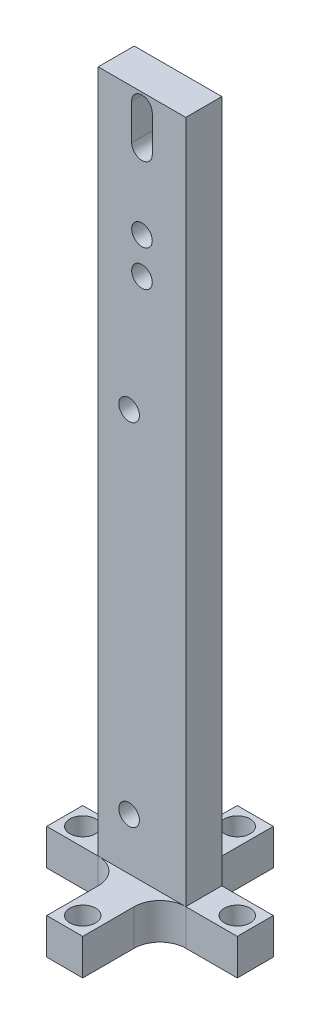
ISO-10303-21;
HEADER;
FILE_DESCRIPTION(('STEP AP214'),'2;1');
FILE_NAME('part.step','',(''),(''),'','','');
FILE_SCHEMA(('AUTOMOTIVE_DESIGN { 1 0 10303 214 1 1 1 1 }'));
ENDSEC;
DATA;
#1=APPLICATION_CONTEXT('core data for automotive mechanical design processes');
#2=APPLICATION_PROTOCOL_DEFINITION('international standard','automotive_design',2000,#1);
#3=PRODUCT_CONTEXT('',#1,'mechanical');
#4=PRODUCT('Part','Part','',(#3));
#5=PRODUCT_RELATED_PRODUCT_CATEGORY('part','',(#4));
#6=PRODUCT_DEFINITION_FORMATION('','',#4);
#7=PRODUCT_DEFINITION_CONTEXT('part definition',#1,'design');
#8=PRODUCT_DEFINITION('design','',#6,#7);
#9=PRODUCT_DEFINITION_SHAPE('','',#8);
#10=(LENGTH_UNIT() NAMED_UNIT(*) SI_UNIT(.MILLI.,.METRE.));
#11=(NAMED_UNIT(*) PLANE_ANGLE_UNIT() SI_UNIT($,.RADIAN.));
#12=(NAMED_UNIT(*) SI_UNIT($,.STERADIAN.) SOLID_ANGLE_UNIT());
#13=UNCERTAINTY_MEASURE_WITH_UNIT(LENGTH_MEASURE(1.E-05),#10,'distance_accuracy_value','');
#14=(GEOMETRIC_REPRESENTATION_CONTEXT(3) GLOBAL_UNCERTAINTY_ASSIGNED_CONTEXT((#13)) GLOBAL_UNIT_ASSIGNED_CONTEXT((#10,
#11,#12)) REPRESENTATION_CONTEXT('',''));
#15=CARTESIAN_POINT('',(0.,0.,0.));
#16=DIRECTION('',(0.,0.,1.));
#17=DIRECTION('',(1.,0.,0.));
#18=AXIS2_PLACEMENT_3D('',#15,#16,#17);
#19=CARTESIAN_POINT('',(8.5,139.7,3.5));
#20=DIRECTION('',(0.,0.,-1.));
#21=DIRECTION('',(-1.,0.,0.));
#22=AXIS2_PLACEMENT_3D('',#19,#20,#21);
#23=PLANE('',#22);
#24=DIRECTION('',(1.,0.,0.));
#25=VECTOR('',#24,1.);
#26=CARTESIAN_POINT('',(3.5,7.,3.5));
#27=LINE('',#26,#25);
#28=CARTESIAN_POINT('',(8.5,7.,3.5));
#29=VERTEX_POINT('',#28);
#30=CARTESIAN_POINT('',(18.5,7.,3.5));
#31=VERTEX_POINT('',#30);
#32=EDGE_CURVE('E306',#29,#31,#27,.T.);
#33=ORIENTED_EDGE('',*,*,#32,.F.);
#34=DIRECTION('',(0.,-1.,0.));
#35=VECTOR('',#34,1.);
#36=CARTESIAN_POINT('',(8.5,0.,3.5));
#37=LINE('',#36,#35);
#38=CARTESIAN_POINT('',(8.5,0.,3.5));
#39=VERTEX_POINT('',#38);
#40=EDGE_CURVE('E456',#29,#39,#37,.T.);
#41=ORIENTED_EDGE('',*,*,#40,.T.);
#42=DIRECTION('',(1.,0.,0.));
#43=VECTOR('',#42,1.);
#44=CARTESIAN_POINT('',(8.5,0.,3.5));
#45=LINE('',#44,#43);
#46=CARTESIAN_POINT('',(18.5,0.,3.5));
#47=VERTEX_POINT('',#46);
#48=EDGE_CURVE('E395',#39,#47,#45,.T.);
#49=ORIENTED_EDGE('',*,*,#48,.T.);
#50=DIRECTION('',(0.,-1.,0.));
#51=VECTOR('',#50,1.);
#52=CARTESIAN_POINT('',(18.5,7.,3.5));
#53=LINE('',#52,#51);
#54=EDGE_CURVE('E364',#31,#47,#53,.T.);
#55=ORIENTED_EDGE('',*,*,#54,.F.);
#56=EDGE_LOOP('',(#33,#41,#49,#55));
#57=FACE_BOUND('',#56,.T.);
#58=ADVANCED_FACE('F38',(#57),#23,.F.);
#59=CARTESIAN_POINT('',(-18.5,0.,3.50000000000022));
#60=VERTEX_POINT('',#59);
#61=CARTESIAN_POINT('',(-8.5,0.,3.5));
#62=VERTEX_POINT('',#61);
#63=EDGE_CURVE('E411',#60,#62,#45,.T.);
#64=ORIENTED_EDGE('',*,*,#63,.T.);
#65=DIRECTION('',(0.,-1.,0.));
#66=VECTOR('',#65,1.);
#67=CARTESIAN_POINT('',(-8.5,7.00000000000001,3.5));
#68=LINE('',#67,#66);
#69=CARTESIAN_POINT('',(-8.5,7.00000000000001,3.5));
#70=VERTEX_POINT('',#69);
#71=EDGE_CURVE('E452',#62,#70,#68,.F.);
#72=ORIENTED_EDGE('',*,*,#71,.T.);
#73=DIRECTION('',(1.,0.,0.));
#74=VECTOR('',#73,1.);
#75=CARTESIAN_POINT('',(-18.5,7.,3.50000000000022));
#76=LINE('',#75,#74);
#77=CARTESIAN_POINT('',(-18.5,7.,3.50000000000022));
#78=VERTEX_POINT('',#77);
#79=EDGE_CURVE('E292',#78,#70,#76,.T.);
#80=ORIENTED_EDGE('',*,*,#79,.F.);
#81=DIRECTION('',(0.,-1.,0.));
#82=VECTOR('',#81,1.);
#83=CARTESIAN_POINT('',(-18.5,7.,3.50000000000022));
#84=LINE('',#83,#82);
#85=EDGE_CURVE('E376',#78,#60,#84,.T.);
#86=ORIENTED_EDGE('',*,*,#85,.T.);
#87=EDGE_LOOP('',(#64,#72,#80,#86));
#88=FACE_BOUND('',#87,.T.);
#89=ADVANCED_FACE('F497',(#88),#23,.F.);
#90=CARTESIAN_POINT('',(8.5,139.7,-3.5));
#91=DIRECTION('',(0.,0.,1.));
#92=DIRECTION('',(1.,0.,0.));
#93=AXIS2_PLACEMENT_3D('',#90,#91,#92);
#94=PLANE('',#93);
#95=DIRECTION('',(-1.,0.,0.));
#96=VECTOR('',#95,1.);
#97=CARTESIAN_POINT('',(-8.5,7.,-3.5));
#98=LINE('',#97,#96);
#99=CARTESIAN_POINT('',(-8.5,7.00000000000001,-3.5));
#100=VERTEX_POINT('',#99);
#101=CARTESIAN_POINT('',(-18.5,7.,-3.5));
#102=VERTEX_POINT('',#101);
#103=EDGE_CURVE('E285',#100,#102,#98,.T.);
#104=ORIENTED_EDGE('',*,*,#103,.F.);
#105=DIRECTION('',(0.,-1.,0.));
#106=VECTOR('',#105,1.);
#107=CARTESIAN_POINT('',(-8.5,0.,-3.5));
#108=LINE('',#107,#106);
#109=CARTESIAN_POINT('',(-8.5,0.,-3.5));
#110=VERTEX_POINT('',#109);
#111=EDGE_CURVE('E441',#100,#110,#108,.T.);
#112=ORIENTED_EDGE('',*,*,#111,.T.);
#113=DIRECTION('',(-1.,0.,0.));
#114=VECTOR('',#113,1.);
#115=CARTESIAN_POINT('',(8.5,0.,-3.5));
#116=LINE('',#115,#114);
#117=CARTESIAN_POINT('',(-18.5,0.,-3.5));
#118=VERTEX_POINT('',#117);
#119=EDGE_CURVE('E415',#110,#118,#116,.T.);
#120=ORIENTED_EDGE('',*,*,#119,.T.);
#121=DIRECTION('',(0.,-1.,0.));
#122=VECTOR('',#121,1.);
#123=CARTESIAN_POINT('',(-18.5,7.,-3.5));
#124=LINE('',#123,#122);
#125=EDGE_CURVE('E380',#102,#118,#124,.T.);
#126=ORIENTED_EDGE('',*,*,#125,.F.);
#127=EDGE_LOOP('',(#104,#112,#120,#126));
#128=FACE_BOUND('',#127,.T.);
#129=ADVANCED_FACE('F568',(#128),#94,.F.);
#130=CARTESIAN_POINT('',(18.5,0.,-3.5));
#131=VERTEX_POINT('',#130);
#132=CARTESIAN_POINT('',(8.5,0.,-3.5));
#133=VERTEX_POINT('',#132);
#134=EDGE_CURVE('E401',#131,#133,#116,.T.);
#135=ORIENTED_EDGE('',*,*,#134,.T.);
#136=DIRECTION('',(0.,-1.,0.));
#137=VECTOR('',#136,1.);
#138=CARTESIAN_POINT('',(8.5,7.00000000000001,-3.5));
#139=LINE('',#138,#137);
#140=CARTESIAN_POINT('',(8.5,7.,-3.5));
#141=VERTEX_POINT('',#140);
#142=EDGE_CURVE('E437',#133,#141,#139,.F.);
#143=ORIENTED_EDGE('',*,*,#142,.T.);
#144=DIRECTION('',(-1.,0.,0.));
#145=VECTOR('',#144,1.);
#146=CARTESIAN_POINT('',(8.5,7.,-3.5));
#147=LINE('',#146,#145);
#148=CARTESIAN_POINT('',(18.5,7.,-3.5));
#149=VERTEX_POINT('',#148);
#150=EDGE_CURVE('E312',#149,#141,#147,.T.);
#151=ORIENTED_EDGE('',*,*,#150,.F.);
#152=DIRECTION('',(0.,-1.,0.));
#153=VECTOR('',#152,1.);
#154=CARTESIAN_POINT('',(18.5,7.,-3.5));
#155=LINE('',#154,#153);
#156=EDGE_CURVE('E360',#149,#131,#155,.T.);
#157=ORIENTED_EDGE('',*,*,#156,.T.);
#158=EDGE_LOOP('',(#135,#143,#151,#157));
#159=FACE_BOUND('',#158,.T.);
#160=ADVANCED_FACE('F581',(#159),#94,.F.);
#161=CARTESIAN_POINT('',(-8.5,139.7,3.5));
#162=DIRECTION('',(1.,0.,0.));
#163=DIRECTION('',(0.,0.,-1.));
#164=AXIS2_PLACEMENT_3D('',#161,#162,#163);
#165=PLANE('',#164);
#166=DIRECTION('',(0.,-1.,0.));
#167=VECTOR('',#166,1.);
#168=CARTESIAN_POINT('',(-8.5,139.7,-3.5));
#169=LINE('',#168,#167);
#170=CARTESIAN_POINT('',(-8.5,139.7,-3.5));
#171=VERTEX_POINT('',#170);
#172=EDGE_CURVE('E410',#171,#100,#169,.T.);
#173=ORIENTED_EDGE('',*,*,#172,.T.);
#174=DIRECTION('',(0.,0.,1.));
#175=VECTOR('',#174,1.);
#176=CARTESIAN_POINT('',(-8.5,7.00000000000001,3.5));
#177=LINE('',#176,#175);
#178=EDGE_CURVE('E391',#100,#70,#177,.T.);
#179=ORIENTED_EDGE('',*,*,#178,.T.);
#180=DIRECTION('',(0.,-1.,0.));
#181=VECTOR('',#180,1.);
#182=CARTESIAN_POINT('',(-8.5,139.7,3.5));
#183=LINE('',#182,#181);
#184=CARTESIAN_POINT('',(-8.5,139.7,3.5));
#185=VERTEX_POINT('',#184);
#186=EDGE_CURVE('E430',#185,#70,#183,.T.);
#187=ORIENTED_EDGE('',*,*,#186,.F.);
#188=DIRECTION('',(0.,0.,1.));
#189=VECTOR('',#188,1.);
#190=CARTESIAN_POINT('',(-8.5,139.7,3.5));
#191=LINE('',#190,#189);
#192=EDGE_CURVE('E396',#171,#185,#191,.T.);
#193=ORIENTED_EDGE('',*,*,#192,.F.);
#194=EDGE_LOOP('',(#173,#179,#187,#193));
#195=FACE_BOUND('',#194,.T.);
#196=ADVANCED_FACE('F573',(#195),#165,.F.);
#197=DIRECTION('',(0.,-1.,0.));
#198=VECTOR('',#197,1.);
#199=CARTESIAN_POINT('',(-2.00000000000002,137.2,3.5));
#200=LINE('',#199,#198);
#201=CARTESIAN_POINT('',(-2.00000000000002,137.2,3.5));
#202=VERTEX_POINT('',#201);
#203=CARTESIAN_POINT('',(-2.00000000000003,130.2,3.5));
#204=VERTEX_POINT('',#203);
#205=EDGE_CURVE('E200',#202,#204,#200,.T.);
#206=ORIENTED_EDGE('',*,*,#205,.F.);
#207=CARTESIAN_POINT('',(0.,137.2,3.5));
#208=DIRECTION('',(0.,0.,1.));
#209=DIRECTION('',(1.,0.,0.));
#210=AXIS2_PLACEMENT_3D('',#207,#208,#209);
#211=CIRCLE('',#210,2.00000000000002);
#212=CARTESIAN_POINT('',(2.00000000000002,137.2,3.5));
#213=VERTEX_POINT('',#212);
#214=EDGE_CURVE('E54',#213,#202,#211,.T.);
#215=ORIENTED_EDGE('',*,*,#214,.F.);
#216=DIRECTION('',(0.,1.,0.));
#217=VECTOR('',#216,1.);
#218=CARTESIAN_POINT('',(2.00000000000002,137.2,3.5));
#219=LINE('',#218,#217);
#220=CARTESIAN_POINT('',(2.00000000000002,130.2,3.5));
#221=VERTEX_POINT('',#220);
#222=EDGE_CURVE('E208',#221,#213,#219,.T.);
#223=ORIENTED_EDGE('',*,*,#222,.F.);
#224=CARTESIAN_POINT('',(0.,130.2,3.5));
#225=DIRECTION('',(0.,0.,1.));
#226=DIRECTION('',(1.,0.,0.));
#227=AXIS2_PLACEMENT_3D('',#224,#225,#226);
#228=CIRCLE('',#227,2.00000000000001);
#229=EDGE_CURVE('E190',#204,#221,#228,.T.);
#230=ORIENTED_EDGE('',*,*,#229,.F.);
#231=EDGE_LOOP('',(#206,#215,#223,#230));
#232=FACE_BOUND('',#231,.T.);
#233=CARTESIAN_POINT('',(1.0704264272351E-13,108.7,3.5));
#234=DIRECTION('',(0.,0.,1.));
#235=DIRECTION('',(1.,0.,0.));
#236=AXIS2_PLACEMENT_3D('',#233,#234,#235);
#237=CIRCLE('',#236,2.);
#238=CARTESIAN_POINT('',(2.00000000000011,108.7,3.5));
#239=VERTEX_POINT('',#238);
#240=EDGE_CURVE('E225',#239,#239,#237,.T.);
#241=ORIENTED_EDGE('',*,*,#240,.F.);
#242=EDGE_LOOP('',(#241));
#243=FACE_BOUND('',#242,.T.);
#244=CARTESIAN_POINT('',(0.,115.7,3.5));
#245=DIRECTION('',(0.,0.,1.));
#246=DIRECTION('',(1.,0.,0.));
#247=AXIS2_PLACEMENT_3D('',#244,#245,#246);
#248=CIRCLE('',#247,2.);
#249=CARTESIAN_POINT('',(2.00000000000001,115.7,3.5));
#250=VERTEX_POINT('',#249);
#251=EDGE_CURVE('E227',#250,#250,#248,.T.);
#252=ORIENTED_EDGE('',*,*,#251,.F.);
#253=EDGE_LOOP('',(#252));
#254=FACE_BOUND('',#253,.T.);
#255=CARTESIAN_POINT('',(-2.5,85.072,3.5));
#256=DIRECTION('',(0.,0.,1.));
#257=DIRECTION('',(1.,0.,0.));
#258=AXIS2_PLACEMENT_3D('',#255,#256,#257);
#259=CIRCLE('',#258,2.00000000000001);
#260=CARTESIAN_POINT('',(-0.499999999999995,85.072,3.5));
#261=VERTEX_POINT('',#260);
#262=EDGE_CURVE('E237',#261,#261,#259,.T.);
#263=ORIENTED_EDGE('',*,*,#262,.F.);
#264=EDGE_LOOP('',(#263));
#265=FACE_BOUND('',#264,.T.);
#266=CARTESIAN_POINT('',(-2.49999999999999,17.,3.5));
#267=DIRECTION('',(0.,0.,1.));
#268=DIRECTION('',(1.,0.,0.));
#269=AXIS2_PLACEMENT_3D('',#266,#267,#268);
#270=CIRCLE('',#269,2.00000000000001);
#271=CARTESIAN_POINT('',(-0.499999999999987,17.,3.5));
#272=VERTEX_POINT('',#271);
#273=EDGE_CURVE('E236',#272,#272,#270,.T.);
#274=ORIENTED_EDGE('',*,*,#273,.F.);
#275=EDGE_LOOP('',(#274));
#276=FACE_BOUND('',#275,.T.);
#277=DIRECTION('',(1.,0.,0.));
#278=VECTOR('',#277,1.);
#279=CARTESIAN_POINT('',(8.5,7.00000000000001,3.5));
#280=LINE('',#279,#278);
#281=EDGE_CURVE('E388',#70,#29,#280,.T.);
#282=ORIENTED_EDGE('',*,*,#281,.T.);
#283=DIRECTION('',(0.,-1.,0.));
#284=VECTOR('',#283,1.);
#285=CARTESIAN_POINT('',(8.5,139.7,3.5));
#286=LINE('',#285,#284);
#287=CARTESIAN_POINT('',(8.5,139.7,3.5));
#288=VERTEX_POINT('',#287);
#289=EDGE_CURVE('E426',#288,#29,#286,.T.);
#290=ORIENTED_EDGE('',*,*,#289,.F.);
#291=DIRECTION('',(1.,0.,0.));
#292=VECTOR('',#291,1.);
#293=CARTESIAN_POINT('',(8.5,139.7,3.5));
#294=LINE('',#293,#292);
#295=EDGE_CURVE('E400',#185,#288,#294,.T.);
#296=ORIENTED_EDGE('',*,*,#295,.F.);
#297=ORIENTED_EDGE('',*,*,#186,.T.);
#298=EDGE_LOOP('',(#282,#290,#296,#297));
#299=FACE_BOUND('',#298,.T.);
#300=ADVANCED_FACE('F205',(#232,#243,#254,#265,#276,#299),#23,.F.);
#301=CARTESIAN_POINT('',(8.5,139.7,3.5));
#302=DIRECTION('',(-1.,0.,0.));
#303=DIRECTION('',(0.,0.,1.));
#304=AXIS2_PLACEMENT_3D('',#301,#302,#303);
#305=PLANE('',#304);
#306=ORIENTED_EDGE('',*,*,#289,.T.);
#307=DIRECTION('',(0.,0.,-1.));
#308=VECTOR('',#307,1.);
#309=CARTESIAN_POINT('',(8.5,7.00000000000001,3.5));
#310=LINE('',#309,#308);
#311=EDGE_CURVE('E384',#29,#141,#310,.T.);
#312=ORIENTED_EDGE('',*,*,#311,.T.);
#313=DIRECTION('',(0.,-1.,0.));
#314=VECTOR('',#313,1.);
#315=CARTESIAN_POINT('',(8.5,139.7,-3.5));
#316=LINE('',#315,#314);
#317=CARTESIAN_POINT('',(8.5,139.7,-3.5));
#318=VERTEX_POINT('',#317);
#319=EDGE_CURVE('E422',#318,#141,#316,.T.);
#320=ORIENTED_EDGE('',*,*,#319,.F.);
#321=DIRECTION('',(0.,0.,-1.));
#322=VECTOR('',#321,1.);
#323=CARTESIAN_POINT('',(8.5,139.7,3.5));
#324=LINE('',#323,#322);
#325=EDGE_CURVE('E404',#288,#318,#324,.T.);
#326=ORIENTED_EDGE('',*,*,#325,.F.);
#327=EDGE_LOOP('',(#306,#312,#320,#326));
#328=FACE_BOUND('',#327,.T.);
#329=ADVANCED_FACE('F572',(#328),#305,.F.);
#330=DIRECTION('',(0.,-1.,0.));
#331=VECTOR('',#330,1.);
#332=CARTESIAN_POINT('',(2.00000000000002,137.2,-3.5));
#333=LINE('',#332,#331);
#334=CARTESIAN_POINT('',(2.00000000000002,137.2,-3.5));
#335=VERTEX_POINT('',#334);
#336=CARTESIAN_POINT('',(2.,130.2,-3.5));
#337=VERTEX_POINT('',#336);
#338=EDGE_CURVE('E535',#335,#337,#333,.T.);
#339=ORIENTED_EDGE('',*,*,#338,.F.);
#340=CARTESIAN_POINT('',(0.,137.2,-3.5));
#341=DIRECTION('',(0.,0.,1.));
#342=DIRECTION('',(1.,0.,0.));
#343=AXIS2_PLACEMENT_3D('',#340,#341,#342);
#344=CIRCLE('',#343,2.00000000000002);
#345=CARTESIAN_POINT('',(-2.00000000000002,137.2,-3.5));
#346=VERTEX_POINT('',#345);
#347=EDGE_CURVE('E226',#346,#335,#344,.F.);
#348=ORIENTED_EDGE('',*,*,#347,.F.);
#349=DIRECTION('',(0.,1.,0.));
#350=VECTOR('',#349,1.);
#351=CARTESIAN_POINT('',(-2.00000000000002,137.2,-3.5));
#352=LINE('',#351,#350);
#353=CARTESIAN_POINT('',(-2.00000000000001,130.2,-3.5));
#354=VERTEX_POINT('',#353);
#355=EDGE_CURVE('E222',#354,#346,#352,.T.);
#356=ORIENTED_EDGE('',*,*,#355,.F.);
#357=CARTESIAN_POINT('',(0.,130.2,-3.5));
#358=DIRECTION('',(0.,0.,1.));
#359=DIRECTION('',(1.,0.,0.));
#360=AXIS2_PLACEMENT_3D('',#357,#358,#359);
#361=CIRCLE('',#360,2.00000000000001);
#362=EDGE_CURVE('E193',#337,#354,#361,.F.);
#363=ORIENTED_EDGE('',*,*,#362,.F.);
#364=EDGE_LOOP('',(#339,#348,#356,#363));
#365=FACE_BOUND('',#364,.T.);
#366=CARTESIAN_POINT('',(1.0704264272351E-13,108.7,-3.5));
#367=DIRECTION('',(0.,0.,1.));
#368=DIRECTION('',(1.,0.,0.));
#369=AXIS2_PLACEMENT_3D('',#366,#367,#368);
#370=CIRCLE('',#369,2.);
#371=CARTESIAN_POINT('',(2.00000000000011,108.7,-3.5));
#372=VERTEX_POINT('',#371);
#373=EDGE_CURVE('E232',#372,#372,#370,.F.);
#374=ORIENTED_EDGE('',*,*,#373,.F.);
#375=EDGE_LOOP('',(#374));
#376=FACE_BOUND('',#375,.T.);
#377=CARTESIAN_POINT('',(0.,115.7,-3.5));
#378=DIRECTION('',(0.,0.,1.));
#379=DIRECTION('',(1.,0.,0.));
#380=AXIS2_PLACEMENT_3D('',#377,#378,#379);
#381=CIRCLE('',#380,2.);
#382=CARTESIAN_POINT('',(2.00000000000001,115.7,-3.5));
#383=VERTEX_POINT('',#382);
#384=EDGE_CURVE('E231',#383,#383,#381,.F.);
#385=ORIENTED_EDGE('',*,*,#384,.F.);
#386=EDGE_LOOP('',(#385));
#387=FACE_BOUND('',#386,.T.);
#388=CARTESIAN_POINT('',(-2.5,85.072,-3.5));
#389=DIRECTION('',(0.,0.,1.));
#390=DIRECTION('',(1.,0.,0.));
#391=AXIS2_PLACEMENT_3D('',#388,#389,#390);
#392=CIRCLE('',#391,2.00000000000001);
#393=CARTESIAN_POINT('',(-0.499999999999995,85.072,-3.5));
#394=VERTEX_POINT('',#393);
#395=EDGE_CURVE('E241',#394,#394,#392,.F.);
#396=ORIENTED_EDGE('',*,*,#395,.F.);
#397=EDGE_LOOP('',(#396));
#398=FACE_BOUND('',#397,.T.);
#399=CARTESIAN_POINT('',(-2.49999999999999,17.,-3.5));
#400=DIRECTION('',(0.,0.,1.));
#401=DIRECTION('',(1.,0.,0.));
#402=AXIS2_PLACEMENT_3D('',#399,#400,#401);
#403=CIRCLE('',#402,2.00000000000001);
#404=CARTESIAN_POINT('',(-0.499999999999987,17.,-3.5));
#405=VERTEX_POINT('',#404);
#406=EDGE_CURVE('E242',#405,#405,#403,.F.);
#407=ORIENTED_EDGE('',*,*,#406,.F.);
#408=EDGE_LOOP('',(#407));
#409=FACE_BOUND('',#408,.T.);
#410=DIRECTION('',(-1.,0.,0.));
#411=VECTOR('',#410,1.);
#412=CARTESIAN_POINT('',(8.5,7.00000000000001,-3.5));
#413=LINE('',#412,#411);
#414=EDGE_CURVE('E434',#141,#100,#413,.T.);
#415=ORIENTED_EDGE('',*,*,#414,.T.);
#416=ORIENTED_EDGE('',*,*,#172,.F.);
#417=DIRECTION('',(-1.,0.,0.));
#418=VECTOR('',#417,1.);
#419=CARTESIAN_POINT('',(8.5,139.7,-3.5));
#420=LINE('',#419,#418);
#421=EDGE_CURVE('E407',#318,#171,#420,.T.);
#422=ORIENTED_EDGE('',*,*,#421,.F.);
#423=ORIENTED_EDGE('',*,*,#319,.T.);
#424=EDGE_LOOP('',(#415,#416,#422,#423));
#425=FACE_BOUND('',#424,.T.);
#426=ADVANCED_FACE('F547',(#365,#376,#387,#398,#409,#425),#94,.F.);
#427=CARTESIAN_POINT('',(0.,139.7,0.));
#428=DIRECTION('',(0.,1.,0.));
#429=DIRECTION('',(0.,0.,1.));
#430=AXIS2_PLACEMENT_3D('',#427,#428,#429);
#431=PLANE('',#430);
#432=ORIENTED_EDGE('',*,*,#192,.T.);
#433=ORIENTED_EDGE('',*,*,#295,.T.);
#434=ORIENTED_EDGE('',*,*,#325,.T.);
#435=ORIENTED_EDGE('',*,*,#421,.T.);
#436=EDGE_LOOP('',(#432,#433,#434,#435));
#437=FACE_BOUND('',#436,.T.);
#438=ADVANCED_FACE('F663',(#437),#431,.T.);
#439=CARTESIAN_POINT('',(0.,0.,0.));
#440=DIRECTION('',(0.,1.,0.));
#441=DIRECTION('',(0.,0.,1.));
#442=AXIS2_PLACEMENT_3D('',#439,#440,#441);
#443=PLANE('',#442);
#444=ORIENTED_EDGE('',*,*,#63,.F.);
#445=DIRECTION('',(0.,0.,1.));
#446=VECTOR('',#445,1.);
#447=CARTESIAN_POINT('',(-18.5,0.,-3.5));
#448=LINE('',#447,#446);
#449=EDGE_CURVE('E281',#118,#60,#448,.T.);
#450=ORIENTED_EDGE('',*,*,#449,.F.);
#451=ORIENTED_EDGE('',*,*,#119,.F.);
#452=CARTESIAN_POINT('',(-8.5,0.,-8.5));
#453=DIRECTION('',(0.,1.,0.));
#454=DIRECTION('',(0.,0.,1.));
#455=AXIS2_PLACEMENT_3D('',#452,#453,#454);
#456=CIRCLE('',#455,5.);
#457=CARTESIAN_POINT('',(-3.5,0.,-8.5));
#458=VERTEX_POINT('',#457);
#459=EDGE_CURVE('E467',#110,#458,#456,.T.);
#460=ORIENTED_EDGE('',*,*,#459,.T.);
#461=DIRECTION('',(0.,0.,1.));
#462=VECTOR('',#461,1.);
#463=CARTESIAN_POINT('',(-3.5,0.,-3.5));
#464=LINE('',#463,#462);
#465=CARTESIAN_POINT('',(-3.5,0.,-18.5));
#466=VERTEX_POINT('',#465);
#467=EDGE_CURVE('E289',#466,#458,#464,.T.);
#468=ORIENTED_EDGE('',*,*,#467,.F.);
#469=DIRECTION('',(-1.,0.,0.));
#470=VECTOR('',#469,1.);
#471=CARTESIAN_POINT('',(-3.5,0.,-18.5));
#472=LINE('',#471,#470);
#473=CARTESIAN_POINT('',(3.5,0.,-18.5));
#474=VERTEX_POINT('',#473);
#475=EDGE_CURVE('E347',#474,#466,#472,.T.);
#476=ORIENTED_EDGE('',*,*,#475,.F.);
#477=DIRECTION('',(0.,0.,-1.));
#478=VECTOR('',#477,1.);
#479=CARTESIAN_POINT('',(3.5,0.,-18.5));
#480=LINE('',#479,#478);
#481=CARTESIAN_POINT('',(3.5,0.,-8.5));
#482=VERTEX_POINT('',#481);
#483=EDGE_CURVE('E344',#482,#474,#480,.T.);
#484=ORIENTED_EDGE('',*,*,#483,.F.);
#485=CARTESIAN_POINT('',(8.5,0.,-8.5));
#486=DIRECTION('',(0.,1.,0.));
#487=DIRECTION('',(0.,0.,1.));
#488=AXIS2_PLACEMENT_3D('',#485,#486,#487);
#489=CIRCLE('',#488,5.);
#490=EDGE_CURVE('E474',#482,#133,#489,.T.);
#491=ORIENTED_EDGE('',*,*,#490,.T.);
#492=ORIENTED_EDGE('',*,*,#134,.F.);
#493=DIRECTION('',(0.,0.,-1.));
#494=VECTOR('',#493,1.);
#495=CARTESIAN_POINT('',(18.5,0.,-3.5));
#496=LINE('',#495,#494);
#497=EDGE_CURVE('E340',#47,#131,#496,.T.);
#498=ORIENTED_EDGE('',*,*,#497,.F.);
#499=ORIENTED_EDGE('',*,*,#48,.F.);
#500=CARTESIAN_POINT('',(8.5,0.,8.5));
#501=DIRECTION('',(0.,1.,0.));
#502=DIRECTION('',(0.,0.,1.));
#503=AXIS2_PLACEMENT_3D('',#500,#501,#502);
#504=CIRCLE('',#503,5.);
#505=CARTESIAN_POINT('',(3.5,0.,8.5));
#506=VERTEX_POINT('',#505);
#507=EDGE_CURVE('E480',#39,#506,#504,.T.);
#508=ORIENTED_EDGE('',*,*,#507,.T.);
#509=DIRECTION('',(0.,0.,-1.));
#510=VECTOR('',#509,1.);
#511=CARTESIAN_POINT('',(3.5,0.,18.5));
#512=LINE('',#511,#510);
#513=CARTESIAN_POINT('',(3.5,0.,18.5));
#514=VERTEX_POINT('',#513);
#515=EDGE_CURVE('E336',#514,#506,#512,.T.);
#516=ORIENTED_EDGE('',*,*,#515,.F.);
#517=DIRECTION('',(1.,0.,0.));
#518=VECTOR('',#517,1.);
#519=CARTESIAN_POINT('',(-3.5,0.,18.5));
#520=LINE('',#519,#518);
#521=CARTESIAN_POINT('',(-3.5,0.,18.5));
#522=VERTEX_POINT('',#521);
#523=EDGE_CURVE('E333',#522,#514,#520,.T.);
#524=ORIENTED_EDGE('',*,*,#523,.F.);
#525=DIRECTION('',(0.,0.,1.));
#526=VECTOR('',#525,1.);
#527=CARTESIAN_POINT('',(-3.5,0.,3.5));
#528=LINE('',#527,#526);
#529=CARTESIAN_POINT('',(-3.5,0.,8.5));
#530=VERTEX_POINT('',#529);
#531=EDGE_CURVE('E330',#530,#522,#528,.T.);
#532=ORIENTED_EDGE('',*,*,#531,.F.);
#533=CARTESIAN_POINT('',(-8.5,0.,8.5));
#534=DIRECTION('',(0.,1.,0.));
#535=DIRECTION('',(0.,0.,1.));
#536=AXIS2_PLACEMENT_3D('',#533,#534,#535);
#537=CIRCLE('',#536,5.);
#538=EDGE_CURVE('E47',#530,#62,#537,.T.);
#539=ORIENTED_EDGE('',*,*,#538,.T.);
#540=EDGE_LOOP('',(#444,#450,#451,#460,#468,#476,#484,#491,#492,#498,#499,#508,#516,#524,#532,#539));
#541=FACE_BOUND('',#540,.T.);
#542=CARTESIAN_POINT('',(0.,0.,-15.));
#543=DIRECTION('',(0.,1.,0.));
#544=DIRECTION('',(0.,0.,1.));
#545=AXIS2_PLACEMENT_3D('',#542,#543,#544);
#546=CIRCLE('',#545,2.5);
#547=CARTESIAN_POINT('',(0.,0.,-12.5));
#548=VERTEX_POINT('',#547);
#549=EDGE_CURVE('E273',#548,#548,#546,.T.);
#550=ORIENTED_EDGE('',*,*,#549,.T.);
#551=EDGE_LOOP('',(#550));
#552=FACE_BOUND('',#551,.T.);
#553=CARTESIAN_POINT('',(15.,0.,0.));
#554=DIRECTION('',(0.,1.,0.));
#555=DIRECTION('',(0.,0.,1.));
#556=AXIS2_PLACEMENT_3D('',#553,#554,#555);
#557=CIRCLE('',#556,2.5);
#558=CARTESIAN_POINT('',(15.,0.,2.5));
#559=VERTEX_POINT('',#558);
#560=EDGE_CURVE('E265',#559,#559,#557,.T.);
#561=ORIENTED_EDGE('',*,*,#560,.T.);
#562=EDGE_LOOP('',(#561));
#563=FACE_BOUND('',#562,.T.);
#564=CARTESIAN_POINT('',(0.,0.,15.));
#565=DIRECTION('',(0.,1.,0.));
#566=DIRECTION('',(0.,0.,1.));
#567=AXIS2_PLACEMENT_3D('',#564,#565,#566);
#568=CIRCLE('',#567,2.5);
#569=CARTESIAN_POINT('',(0.,0.,17.5));
#570=VERTEX_POINT('',#569);
#571=EDGE_CURVE('E257',#570,#570,#568,.T.);
#572=ORIENTED_EDGE('',*,*,#571,.T.);
#573=EDGE_LOOP('',(#572));
#574=FACE_BOUND('',#573,.T.);
#575=CARTESIAN_POINT('',(-15.,0.,0.));
#576=DIRECTION('',(0.,1.,0.));
#577=DIRECTION('',(0.,0.,1.));
#578=AXIS2_PLACEMENT_3D('',#575,#576,#577);
#579=CIRCLE('',#578,2.5);
#580=CARTESIAN_POINT('',(-15.,0.,2.5));
#581=VERTEX_POINT('',#580);
#582=EDGE_CURVE('E246',#581,#581,#579,.T.);
#583=ORIENTED_EDGE('',*,*,#582,.T.);
#584=EDGE_LOOP('',(#583));
#585=FACE_BOUND('',#584,.T.);
#586=ADVANCED_FACE('F489',(#541,#552,#563,#574,#585),#443,.F.);
#587=CARTESIAN_POINT('',(0.,7.,-15.));
#588=DIRECTION('',(0.,-1.,0.));
#589=DIRECTION('',(0.,0.,-1.));
#590=AXIS2_PLACEMENT_3D('',#587,#588,#589);
#591=CYLINDRICAL_SURFACE('',#590,2.5);
#592=CARTESIAN_POINT('',(0.,7.,-15.));
#593=DIRECTION('',(0.,1.,0.));
#594=DIRECTION('',(0.,0.,1.));
#595=AXIS2_PLACEMENT_3D('',#592,#593,#594);
#596=CIRCLE('',#595,2.5);
#597=CARTESIAN_POINT('',(0.,7.,-12.5));
#598=VERTEX_POINT('',#597);
#599=EDGE_CURVE('E277',#598,#598,#596,.T.);
#600=ORIENTED_EDGE('',*,*,#599,.T.);
#601=EDGE_LOOP('',(#600));
#602=FACE_BOUND('',#601,.T.);
#603=ORIENTED_EDGE('',*,*,#549,.F.);
#604=EDGE_LOOP('',(#603));
#605=FACE_BOUND('',#604,.T.);
#606=ADVANCED_FACE('F630',(#602,#605),#591,.F.);
#607=CARTESIAN_POINT('',(-3.5,7.,-18.5));
#608=DIRECTION('',(0.,0.,1.));
#609=DIRECTION('',(1.,0.,0.));
#610=AXIS2_PLACEMENT_3D('',#607,#608,#609);
#611=PLANE('',#610);
#612=ORIENTED_EDGE('',*,*,#475,.T.);
#613=DIRECTION('',(0.,-1.,0.));
#614=VECTOR('',#613,1.);
#615=CARTESIAN_POINT('',(-3.5,7.,-18.5));
#616=LINE('',#615,#614);
#617=CARTESIAN_POINT('',(-3.5,7.,-18.5));
#618=VERTEX_POINT('',#617);
#619=EDGE_CURVE('E326',#618,#466,#616,.T.);
#620=ORIENTED_EDGE('',*,*,#619,.F.);
#621=DIRECTION('',(-1.,0.,0.));
#622=VECTOR('',#621,1.);
#623=CARTESIAN_POINT('',(-3.5,7.,-18.5));
#624=LINE('',#623,#622);
#625=CARTESIAN_POINT('',(3.5,7.,-18.5));
#626=VERTEX_POINT('',#625);
#627=EDGE_CURVE('E319',#626,#618,#624,.T.);
#628=ORIENTED_EDGE('',*,*,#627,.F.);
#629=DIRECTION('',(0.,-1.,0.));
#630=VECTOR('',#629,1.);
#631=CARTESIAN_POINT('',(3.5,7.,-18.5));
#632=LINE('',#631,#630);
#633=EDGE_CURVE('E356',#626,#474,#632,.T.);
#634=ORIENTED_EDGE('',*,*,#633,.T.);
#635=EDGE_LOOP('',(#612,#620,#628,#634));
#636=FACE_BOUND('',#635,.T.);
#637=ADVANCED_FACE('F633',(#636),#611,.F.);
#638=CARTESIAN_POINT('',(-3.5,7.,-3.5));
#639=DIRECTION('',(1.,0.,0.));
#640=DIRECTION('',(0.,0.,-1.));
#641=AXIS2_PLACEMENT_3D('',#638,#639,#640);
#642=PLANE('',#641);
#643=ORIENTED_EDGE('',*,*,#467,.T.);
#644=DIRECTION('',(0.,-1.,0.));
#645=VECTOR('',#644,1.);
#646=CARTESIAN_POINT('',(-3.5,7.00000000000001,-8.5));
#647=LINE('',#646,#645);
#648=CARTESIAN_POINT('',(-3.5,7.,-8.5));
#649=VERTEX_POINT('',#648);
#650=EDGE_CURVE('E445',#458,#649,#647,.F.);
#651=ORIENTED_EDGE('',*,*,#650,.T.);
#652=DIRECTION('',(0.,0.,1.));
#653=VECTOR('',#652,1.);
#654=CARTESIAN_POINT('',(-3.5,7.,-3.5));
#655=LINE('',#654,#653);
#656=EDGE_CURVE('E322',#618,#649,#655,.T.);
#657=ORIENTED_EDGE('',*,*,#656,.F.);
#658=ORIENTED_EDGE('',*,*,#619,.T.);
#659=EDGE_LOOP('',(#643,#651,#657,#658));
#660=FACE_BOUND('',#659,.T.);
#661=ADVANCED_FACE('F639',(#660),#642,.F.);
#662=CARTESIAN_POINT('',(3.5,7.,-18.5));
#663=DIRECTION('',(-1.,0.,0.));
#664=DIRECTION('',(0.,0.,1.));
#665=AXIS2_PLACEMENT_3D('',#662,#663,#664);
#666=PLANE('',#665);
#667=DIRECTION('',(0.,0.,-1.));
#668=VECTOR('',#667,1.);
#669=CARTESIAN_POINT('',(3.5,7.,-18.5));
#670=LINE('',#669,#668);
#671=CARTESIAN_POINT('',(3.5,7.,-8.5));
#672=VERTEX_POINT('',#671);
#673=EDGE_CURVE('E316',#672,#626,#670,.T.);
#674=ORIENTED_EDGE('',*,*,#673,.F.);
#675=DIRECTION('',(0.,-1.,0.));
#676=VECTOR('',#675,1.);
#677=CARTESIAN_POINT('',(3.5,0.,-8.5));
#678=LINE('',#677,#676);
#679=EDGE_CURVE('E448',#672,#482,#678,.T.);
#680=ORIENTED_EDGE('',*,*,#679,.T.);
#681=ORIENTED_EDGE('',*,*,#483,.T.);
#682=ORIENTED_EDGE('',*,*,#633,.F.);
#683=EDGE_LOOP('',(#674,#680,#681,#682));
#684=FACE_BOUND('',#683,.T.);
#685=ADVANCED_FACE('F642',(#684),#666,.F.);
#686=CARTESIAN_POINT('',(0.,7.,0.));
#687=DIRECTION('',(0.,1.,0.));
#688=DIRECTION('',(0.,0.,1.));
#689=AXIS2_PLACEMENT_3D('',#686,#687,#688);
#690=PLANE('',#689);
#691=ORIENTED_EDGE('',*,*,#599,.F.);
#692=EDGE_LOOP('',(#691));
#693=FACE_BOUND('',#692,.T.);
#694=ORIENTED_EDGE('',*,*,#414,.F.);
#695=CARTESIAN_POINT('',(8.5,7.,-8.5));
#696=DIRECTION('',(0.,1.,0.));
#697=DIRECTION('',(0.,0.,1.));
#698=AXIS2_PLACEMENT_3D('',#695,#696,#697);
#699=CIRCLE('',#698,5.);
#700=EDGE_CURVE('E477',#141,#672,#699,.F.);
#701=ORIENTED_EDGE('',*,*,#700,.T.);
#702=ORIENTED_EDGE('',*,*,#673,.T.);
#703=ORIENTED_EDGE('',*,*,#627,.T.);
#704=ORIENTED_EDGE('',*,*,#656,.T.);
#705=CARTESIAN_POINT('',(-8.5,7.00000000000001,-8.5));
#706=DIRECTION('',(0.,1.,0.));
#707=DIRECTION('',(0.,0.,1.));
#708=AXIS2_PLACEMENT_3D('',#705,#706,#707);
#709=CIRCLE('',#708,5.);
#710=EDGE_CURVE('E470',#649,#100,#709,.F.);
#711=ORIENTED_EDGE('',*,*,#710,.T.);
#712=EDGE_LOOP('',(#694,#701,#702,#703,#704,#711));
#713=FACE_BOUND('',#712,.T.);
#714=ADVANCED_FACE('F628',(#693,#713),#690,.T.);
#715=CARTESIAN_POINT('',(15.,7.,0.));
#716=DIRECTION('',(0.,-1.,0.));
#717=DIRECTION('',(0.,0.,-1.));
#718=AXIS2_PLACEMENT_3D('',#715,#716,#717);
#719=CYLINDRICAL_SURFACE('',#718,2.5);
#720=CARTESIAN_POINT('',(15.,7.,0.));
#721=DIRECTION('',(0.,1.,0.));
#722=DIRECTION('',(0.,0.,1.));
#723=AXIS2_PLACEMENT_3D('',#720,#721,#722);
#724=CIRCLE('',#723,2.5);
#725=CARTESIAN_POINT('',(15.,7.,2.5));
#726=VERTEX_POINT('',#725);
#727=EDGE_CURVE('E269',#726,#726,#724,.T.);
#728=ORIENTED_EDGE('',*,*,#727,.T.);
#729=EDGE_LOOP('',(#728));
#730=FACE_BOUND('',#729,.T.);
#731=ORIENTED_EDGE('',*,*,#560,.F.);
#732=EDGE_LOOP('',(#731));
#733=FACE_BOUND('',#732,.T.);
#734=ADVANCED_FACE('F624',(#730,#733),#719,.F.);
#735=CARTESIAN_POINT('',(18.5,7.,-3.5));
#736=DIRECTION('',(-1.,0.,0.));
#737=DIRECTION('',(0.,0.,1.));
#738=AXIS2_PLACEMENT_3D('',#735,#736,#737);
#739=PLANE('',#738);
#740=ORIENTED_EDGE('',*,*,#497,.T.);
#741=ORIENTED_EDGE('',*,*,#156,.F.);
#742=DIRECTION('',(0.,0.,-1.));
#743=VECTOR('',#742,1.);
#744=CARTESIAN_POINT('',(18.5,7.,-3.5));
#745=LINE('',#744,#743);
#746=EDGE_CURVE('E309',#31,#149,#745,.T.);
#747=ORIENTED_EDGE('',*,*,#746,.F.);
#748=ORIENTED_EDGE('',*,*,#54,.T.);
#749=EDGE_LOOP('',(#740,#741,#747,#748));
#750=FACE_BOUND('',#749,.T.);
#751=ADVANCED_FACE('F627',(#750),#739,.F.);
#752=ORIENTED_EDGE('',*,*,#727,.F.);
#753=EDGE_LOOP('',(#752));
#754=FACE_BOUND('',#753,.T.);
#755=ORIENTED_EDGE('',*,*,#311,.F.);
#756=ORIENTED_EDGE('',*,*,#32,.T.);
#757=ORIENTED_EDGE('',*,*,#746,.T.);
#758=ORIENTED_EDGE('',*,*,#150,.T.);
#759=EDGE_LOOP('',(#755,#756,#757,#758));
#760=FACE_BOUND('',#759,.T.);
#761=ADVANCED_FACE('F622',(#754,#760),#690,.T.);
#762=CARTESIAN_POINT('',(0.,7.,15.));
#763=DIRECTION('',(0.,-1.,0.));
#764=DIRECTION('',(0.,0.,-1.));
#765=AXIS2_PLACEMENT_3D('',#762,#763,#764);
#766=CYLINDRICAL_SURFACE('',#765,2.5);
#767=CARTESIAN_POINT('',(0.,7.,15.));
#768=DIRECTION('',(0.,1.,0.));
#769=DIRECTION('',(0.,0.,1.));
#770=AXIS2_PLACEMENT_3D('',#767,#768,#769);
#771=CIRCLE('',#770,2.5);
#772=CARTESIAN_POINT('',(0.,7.,17.5));
#773=VERTEX_POINT('',#772);
#774=EDGE_CURVE('E261',#773,#773,#771,.T.);
#775=ORIENTED_EDGE('',*,*,#774,.T.);
#776=EDGE_LOOP('',(#775));
#777=FACE_BOUND('',#776,.T.);
#778=ORIENTED_EDGE('',*,*,#571,.F.);
#779=EDGE_LOOP('',(#778));
#780=FACE_BOUND('',#779,.T.);
#781=ADVANCED_FACE('F619',(#777,#780),#766,.F.);
#782=CARTESIAN_POINT('',(-3.5,7.,18.5));
#783=DIRECTION('',(0.,0.,-1.));
#784=DIRECTION('',(-1.,0.,0.));
#785=AXIS2_PLACEMENT_3D('',#782,#783,#784);
#786=PLANE('',#785);
#787=ORIENTED_EDGE('',*,*,#523,.T.);
#788=DIRECTION('',(0.,-1.,0.));
#789=VECTOR('',#788,1.);
#790=CARTESIAN_POINT('',(3.5,7.,18.5));
#791=LINE('',#790,#789);
#792=CARTESIAN_POINT('',(3.5,7.,18.5));
#793=VERTEX_POINT('',#792);
#794=EDGE_CURVE('E368',#793,#514,#791,.T.);
#795=ORIENTED_EDGE('',*,*,#794,.F.);
#796=DIRECTION('',(1.,0.,0.));
#797=VECTOR('',#796,1.);
#798=CARTESIAN_POINT('',(-3.5,7.,18.5));
#799=LINE('',#798,#797);
#800=CARTESIAN_POINT('',(-3.5,7.,18.5));
#801=VERTEX_POINT('',#800);
#802=EDGE_CURVE('E299',#801,#793,#799,.T.);
#803=ORIENTED_EDGE('',*,*,#802,.F.);
#804=DIRECTION('',(0.,-1.,0.));
#805=VECTOR('',#804,1.);
#806=CARTESIAN_POINT('',(-3.5,7.,18.5));
#807=LINE('',#806,#805);
#808=EDGE_CURVE('E372',#801,#522,#807,.T.);
#809=ORIENTED_EDGE('',*,*,#808,.T.);
#810=EDGE_LOOP('',(#787,#795,#803,#809));
#811=FACE_BOUND('',#810,.T.);
#812=ADVANCED_FACE('F510',(#811),#786,.F.);
#813=CARTESIAN_POINT('',(3.5,7.,18.5));
#814=DIRECTION('',(-1.,0.,0.));
#815=DIRECTION('',(0.,0.,1.));
#816=AXIS2_PLACEMENT_3D('',#813,#814,#815);
#817=PLANE('',#816);
#818=ORIENTED_EDGE('',*,*,#515,.T.);
#819=DIRECTION('',(0.,-1.,0.));
#820=VECTOR('',#819,1.);
#821=CARTESIAN_POINT('',(3.5,7.00000000000001,8.5));
#822=LINE('',#821,#820);
#823=CARTESIAN_POINT('',(3.5,7.,8.5));
#824=VERTEX_POINT('',#823);
#825=EDGE_CURVE('E460',#506,#824,#822,.F.);
#826=ORIENTED_EDGE('',*,*,#825,.T.);
#827=DIRECTION('',(0.,0.,-1.));
#828=VECTOR('',#827,1.);
#829=CARTESIAN_POINT('',(3.5,7.,18.5));
#830=LINE('',#829,#828);
#831=EDGE_CURVE('E302',#793,#824,#830,.T.);
#832=ORIENTED_EDGE('',*,*,#831,.F.);
#833=ORIENTED_EDGE('',*,*,#794,.T.);
#834=EDGE_LOOP('',(#818,#826,#832,#833));
#835=FACE_BOUND('',#834,.T.);
#836=ADVANCED_FACE('F653',(#835),#817,.F.);
#837=CARTESIAN_POINT('',(-3.5,7.,3.5));
#838=DIRECTION('',(1.,0.,0.));
#839=DIRECTION('',(0.,0.,-1.));
#840=AXIS2_PLACEMENT_3D('',#837,#838,#839);
#841=PLANE('',#840);
#842=DIRECTION('',(0.,0.,1.));
#843=VECTOR('',#842,1.);
#844=CARTESIAN_POINT('',(-3.5,7.,3.5));
#845=LINE('',#844,#843);
#846=CARTESIAN_POINT('',(-3.5,7.,8.5));
#847=VERTEX_POINT('',#846);
#848=EDGE_CURVE('E296',#847,#801,#845,.T.);
#849=ORIENTED_EDGE('',*,*,#848,.F.);
#850=DIRECTION('',(0.,-1.,0.));
#851=VECTOR('',#850,1.);
#852=CARTESIAN_POINT('',(-3.5,0.,8.5));
#853=LINE('',#852,#851);
#854=EDGE_CURVE('E463',#847,#530,#853,.T.);
#855=ORIENTED_EDGE('',*,*,#854,.T.);
#856=ORIENTED_EDGE('',*,*,#531,.T.);
#857=ORIENTED_EDGE('',*,*,#808,.F.);
#858=EDGE_LOOP('',(#849,#855,#856,#857));
#859=FACE_BOUND('',#858,.T.);
#860=ADVANCED_FACE('F506',(#859),#841,.F.);
#861=ORIENTED_EDGE('',*,*,#774,.F.);
#862=EDGE_LOOP('',(#861));
#863=FACE_BOUND('',#862,.T.);
#864=ORIENTED_EDGE('',*,*,#281,.F.);
#865=CARTESIAN_POINT('',(-8.5,7.,8.5));
#866=DIRECTION('',(0.,1.,0.));
#867=DIRECTION('',(0.,0.,1.));
#868=AXIS2_PLACEMENT_3D('',#865,#866,#867);
#869=CIRCLE('',#868,5.);
#870=EDGE_CURVE('E11',#70,#847,#869,.F.);
#871=ORIENTED_EDGE('',*,*,#870,.T.);
#872=ORIENTED_EDGE('',*,*,#848,.T.);
#873=ORIENTED_EDGE('',*,*,#802,.T.);
#874=ORIENTED_EDGE('',*,*,#831,.T.);
#875=CARTESIAN_POINT('',(8.5,7.00000000000001,8.5));
#876=DIRECTION('',(0.,1.,0.));
#877=DIRECTION('',(0.,0.,1.));
#878=AXIS2_PLACEMENT_3D('',#875,#876,#877);
#879=CIRCLE('',#878,5.);
#880=EDGE_CURVE('E483',#824,#29,#879,.F.);
#881=ORIENTED_EDGE('',*,*,#880,.T.);
#882=EDGE_LOOP('',(#864,#871,#872,#873,#874,#881));
#883=FACE_BOUND('',#882,.T.);
#884=ADVANCED_FACE('F503',(#863,#883),#690,.T.);
#885=CARTESIAN_POINT('',(-15.,7.,0.));
#886=DIRECTION('',(0.,1.,0.));
#887=DIRECTION('',(0.,0.,1.));
#888=AXIS2_PLACEMENT_3D('',#885,#886,#887);
#889=CIRCLE('',#888,2.5);
#890=CARTESIAN_POINT('',(-15.,7.,2.5));
#891=VERTEX_POINT('',#890);
#892=EDGE_CURVE('E253',#891,#891,#889,.T.);
#893=ORIENTED_EDGE('',*,*,#892,.F.);
#894=EDGE_LOOP('',(#893));
#895=FACE_BOUND('',#894,.T.);
#896=ORIENTED_EDGE('',*,*,#178,.F.);
#897=ORIENTED_EDGE('',*,*,#103,.T.);
#898=DIRECTION('',(0.,0.,1.));
#899=VECTOR('',#898,1.);
#900=CARTESIAN_POINT('',(-18.5,7.,-3.5));
#901=LINE('',#900,#899);
#902=EDGE_CURVE('E288',#102,#78,#901,.T.);
#903=ORIENTED_EDGE('',*,*,#902,.T.);
#904=ORIENTED_EDGE('',*,*,#79,.T.);
#905=EDGE_LOOP('',(#896,#897,#903,#904));
#906=FACE_BOUND('',#905,.T.);
#907=ADVANCED_FACE('F635',(#895,#906),#690,.T.);
#908=CARTESIAN_POINT('',(-18.5,7.,-3.5));
#909=DIRECTION('',(1.,0.,0.));
#910=DIRECTION('',(0.,0.,-1.));
#911=AXIS2_PLACEMENT_3D('',#908,#909,#910);
#912=PLANE('',#911);
#913=ORIENTED_EDGE('',*,*,#449,.T.);
#914=ORIENTED_EDGE('',*,*,#85,.F.);
#915=ORIENTED_EDGE('',*,*,#902,.F.);
#916=ORIENTED_EDGE('',*,*,#125,.T.);
#917=EDGE_LOOP('',(#913,#914,#915,#916));
#918=FACE_BOUND('',#917,.T.);
#919=ADVANCED_FACE('F617',(#918),#912,.F.);
#920=CARTESIAN_POINT('',(-15.,7.,0.));
#921=DIRECTION('',(0.,-1.,0.));
#922=DIRECTION('',(0.,0.,-1.));
#923=AXIS2_PLACEMENT_3D('',#920,#921,#922);
#924=CYLINDRICAL_SURFACE('',#923,2.5);
#925=ORIENTED_EDGE('',*,*,#892,.T.);
#926=EDGE_LOOP('',(#925));
#927=FACE_BOUND('',#926,.T.);
#928=ORIENTED_EDGE('',*,*,#582,.F.);
#929=EDGE_LOOP('',(#928));
#930=FACE_BOUND('',#929,.T.);
#931=ADVANCED_FACE('F593',(#927,#930),#924,.F.);
#932=CARTESIAN_POINT('',(-8.5,139.7,-8.5));
#933=DIRECTION('',(0.,1.,0.));
#934=DIRECTION('',(0.,0.,1.));
#935=AXIS2_PLACEMENT_3D('',#932,#933,#934);
#936=CYLINDRICAL_SURFACE('',#935,5.);
#937=ORIENTED_EDGE('',*,*,#710,.F.);
#938=ORIENTED_EDGE('',*,*,#650,.F.);
#939=ORIENTED_EDGE('',*,*,#459,.F.);
#940=ORIENTED_EDGE('',*,*,#111,.F.);
#941=EDGE_LOOP('',(#937,#938,#939,#940));
#942=FACE_BOUND('',#941,.T.);
#943=ADVANCED_FACE('F589',(#942),#936,.F.);
#944=CARTESIAN_POINT('',(8.5,7.,-8.5));
#945=DIRECTION('',(0.,1.,0.));
#946=DIRECTION('',(0.,0.,1.));
#947=AXIS2_PLACEMENT_3D('',#944,#945,#946);
#948=CYLINDRICAL_SURFACE('',#947,5.);
#949=ORIENTED_EDGE('',*,*,#700,.F.);
#950=ORIENTED_EDGE('',*,*,#142,.F.);
#951=ORIENTED_EDGE('',*,*,#490,.F.);
#952=ORIENTED_EDGE('',*,*,#679,.F.);
#953=EDGE_LOOP('',(#949,#950,#951,#952));
#954=FACE_BOUND('',#953,.T.);
#955=ADVANCED_FACE('F592',(#954),#948,.F.);
#956=CARTESIAN_POINT('',(8.5,139.7,8.5));
#957=DIRECTION('',(0.,1.,0.));
#958=DIRECTION('',(0.,0.,1.));
#959=AXIS2_PLACEMENT_3D('',#956,#957,#958);
#960=CYLINDRICAL_SURFACE('',#959,5.);
#961=ORIENTED_EDGE('',*,*,#880,.F.);
#962=ORIENTED_EDGE('',*,*,#825,.F.);
#963=ORIENTED_EDGE('',*,*,#507,.F.);
#964=ORIENTED_EDGE('',*,*,#40,.F.);
#965=EDGE_LOOP('',(#961,#962,#963,#964));
#966=FACE_BOUND('',#965,.T.);
#967=ADVANCED_FACE('F518',(#966),#960,.F.);
#968=CARTESIAN_POINT('',(-8.5,7.,8.5));
#969=DIRECTION('',(0.,1.,0.));
#970=DIRECTION('',(0.,0.,1.));
#971=AXIS2_PLACEMENT_3D('',#968,#969,#970);
#972=CYLINDRICAL_SURFACE('',#971,5.);
#973=ORIENTED_EDGE('',*,*,#870,.F.);
#974=ORIENTED_EDGE('',*,*,#71,.F.);
#975=ORIENTED_EDGE('',*,*,#538,.F.);
#976=ORIENTED_EDGE('',*,*,#854,.F.);
#977=EDGE_LOOP('',(#973,#974,#975,#976));
#978=FACE_BOUND('',#977,.T.);
#979=ADVANCED_FACE('F40',(#978),#972,.F.);
#980=CARTESIAN_POINT('',(-2.49999999999999,17.,-9.15685424949239));
#981=DIRECTION('',(0.,0.,1.));
#982=DIRECTION('',(1.,0.,0.));
#983=AXIS2_PLACEMENT_3D('',#980,#981,#982);
#984=CYLINDRICAL_SURFACE('',#983,2.00000000000001);
#985=ORIENTED_EDGE('',*,*,#406,.T.);
#986=EDGE_LOOP('',(#985));
#987=FACE_BOUND('',#986,.T.);
#988=ORIENTED_EDGE('',*,*,#273,.T.);
#989=EDGE_LOOP('',(#988));
#990=FACE_BOUND('',#989,.T.);
#991=ADVANCED_FACE('F601',(#987,#990),#984,.F.);
#992=CARTESIAN_POINT('',(-2.5,85.072,-9.15685424949239));
#993=DIRECTION('',(0.,0.,1.));
#994=DIRECTION('',(1.,0.,0.));
#995=AXIS2_PLACEMENT_3D('',#992,#993,#994);
#996=CYLINDRICAL_SURFACE('',#995,2.00000000000001);
#997=ORIENTED_EDGE('',*,*,#395,.T.);
#998=EDGE_LOOP('',(#997));
#999=FACE_BOUND('',#998,.T.);
#1000=ORIENTED_EDGE('',*,*,#262,.T.);
#1001=EDGE_LOOP('',(#1000));
#1002=FACE_BOUND('',#1001,.T.);
#1003=ADVANCED_FACE('F605',(#999,#1002),#996,.F.);
#1004=CARTESIAN_POINT('',(0.,115.7,-15.2046999107197));
#1005=DIRECTION('',(0.,0.,1.));
#1006=DIRECTION('',(1.,0.,0.));
#1007=AXIS2_PLACEMENT_3D('',#1004,#1005,#1006);
#1008=CYLINDRICAL_SURFACE('',#1007,2.);
#1009=ORIENTED_EDGE('',*,*,#384,.T.);
#1010=EDGE_LOOP('',(#1009));
#1011=FACE_BOUND('',#1010,.T.);
#1012=ORIENTED_EDGE('',*,*,#251,.T.);
#1013=EDGE_LOOP('',(#1012));
#1014=FACE_BOUND('',#1013,.T.);
#1015=ADVANCED_FACE('F558',(#1011,#1014),#1008,.F.);
#1016=CARTESIAN_POINT('',(1.0704264272351E-13,108.7,-15.2046999107197));
#1017=DIRECTION('',(0.,0.,1.));
#1018=DIRECTION('',(1.,0.,0.));
#1019=AXIS2_PLACEMENT_3D('',#1016,#1017,#1018);
#1020=CYLINDRICAL_SURFACE('',#1019,2.);
#1021=ORIENTED_EDGE('',*,*,#373,.T.);
#1022=EDGE_LOOP('',(#1021));
#1023=FACE_BOUND('',#1022,.T.);
#1024=ORIENTED_EDGE('',*,*,#240,.T.);
#1025=EDGE_LOOP('',(#1024));
#1026=FACE_BOUND('',#1025,.T.);
#1027=ADVANCED_FACE('F551',(#1023,#1026),#1020,.F.);
#1028=CARTESIAN_POINT('',(0.,137.2,-15.2046999107197));
#1029=DIRECTION('',(0.,0.,1.));
#1030=DIRECTION('',(1.,0.,0.));
#1031=AXIS2_PLACEMENT_3D('',#1028,#1029,#1030);
#1032=CYLINDRICAL_SURFACE('',#1031,2.00000000000002);
#1033=ORIENTED_EDGE('',*,*,#347,.T.);
#1034=DIRECTION('',(0.,0.,1.));
#1035=VECTOR('',#1034,1.);
#1036=CARTESIAN_POINT('',(2.00000000000002,137.2,-15.2046999107197));
#1037=LINE('',#1036,#1035);
#1038=EDGE_CURVE('E215',#335,#213,#1037,.T.);
#1039=ORIENTED_EDGE('',*,*,#1038,.T.);
#1040=ORIENTED_EDGE('',*,*,#214,.T.);
#1041=DIRECTION('',(0.,0.,1.));
#1042=VECTOR('',#1041,1.);
#1043=CARTESIAN_POINT('',(-2.00000000000002,137.2,-15.2046999107197));
#1044=LINE('',#1043,#1042);
#1045=EDGE_CURVE('E197',#346,#202,#1044,.T.);
#1046=ORIENTED_EDGE('',*,*,#1045,.F.);
#1047=EDGE_LOOP('',(#1033,#1039,#1040,#1046));
#1048=FACE_BOUND('',#1047,.T.);
#1049=ADVANCED_FACE('F549',(#1048),#1032,.F.);
#1050=CARTESIAN_POINT('',(2.00000000000002,137.2,-15.2046999107197));
#1051=DIRECTION('',(1.,0.,0.));
#1052=DIRECTION('',(0.,1.,0.));
#1053=AXIS2_PLACEMENT_3D('',#1050,#1051,#1052);
#1054=PLANE('',#1053);
#1055=ORIENTED_EDGE('',*,*,#338,.T.);
#1056=DIRECTION('',(0.,0.,1.));
#1057=VECTOR('',#1056,1.);
#1058=CARTESIAN_POINT('',(2.00000000000002,130.2,-15.2046999107197));
#1059=LINE('',#1058,#1057);
#1060=EDGE_CURVE('E196',#337,#221,#1059,.T.);
#1061=ORIENTED_EDGE('',*,*,#1060,.T.);
#1062=ORIENTED_EDGE('',*,*,#222,.T.);
#1063=ORIENTED_EDGE('',*,*,#1038,.F.);
#1064=EDGE_LOOP('',(#1055,#1061,#1062,#1063));
#1065=FACE_BOUND('',#1064,.T.);
#1066=ADVANCED_FACE('F544',(#1065),#1054,.F.);
#1067=CARTESIAN_POINT('',(0.,130.2,-15.2046999107197));
#1068=DIRECTION('',(0.,0.,1.));
#1069=DIRECTION('',(1.,0.,0.));
#1070=AXIS2_PLACEMENT_3D('',#1067,#1068,#1069);
#1071=CYLINDRICAL_SURFACE('',#1070,2.00000000000001);
#1072=ORIENTED_EDGE('',*,*,#362,.T.);
#1073=DIRECTION('',(0.,0.,1.));
#1074=VECTOR('',#1073,1.);
#1075=CARTESIAN_POINT('',(-2.00000000000003,130.2,-15.2046999107197));
#1076=LINE('',#1075,#1074);
#1077=EDGE_CURVE('E62',#354,#204,#1076,.T.);
#1078=ORIENTED_EDGE('',*,*,#1077,.T.);
#1079=ORIENTED_EDGE('',*,*,#229,.T.);
#1080=ORIENTED_EDGE('',*,*,#1060,.F.);
#1081=EDGE_LOOP('',(#1072,#1078,#1079,#1080));
#1082=FACE_BOUND('',#1081,.T.);
#1083=ADVANCED_FACE('F187',(#1082),#1071,.F.);
#1084=CARTESIAN_POINT('',(-2.00000000000002,137.2,-15.2046999107197));
#1085=DIRECTION('',(-1.,0.,0.));
#1086=DIRECTION('',(0.,-1.,0.));
#1087=AXIS2_PLACEMENT_3D('',#1084,#1085,#1086);
#1088=PLANE('',#1087);
#1089=ORIENTED_EDGE('',*,*,#355,.T.);
#1090=ORIENTED_EDGE('',*,*,#1045,.T.);
#1091=ORIENTED_EDGE('',*,*,#205,.T.);
#1092=ORIENTED_EDGE('',*,*,#1077,.F.);
#1093=EDGE_LOOP('',(#1089,#1090,#1091,#1092));
#1094=FACE_BOUND('',#1093,.T.);
#1095=ADVANCED_FACE('F201',(#1094),#1088,.F.);
#1096=CLOSED_SHELL('',(#58,#89,#129,#160,#196,#300,#329,#426,#438,#586,#606,#637,#661,#685,#714,
#734,#751,#761,#781,#812,#836,#860,#884,#907,#919,#931,#943,#955,#967,#979,#991,#1003,#1015,
#1027,#1049,#1066,#1083,#1095));
#1097=MANIFOLD_SOLID_BREP('B2',#1096);
#1098=ADVANCED_BREP_SHAPE_REPRESENTATION('',(#18,#1097),#14);
#1099=SHAPE_DEFINITION_REPRESENTATION(#9,#1098);
ENDSEC;
END-ISO-10303-21;
